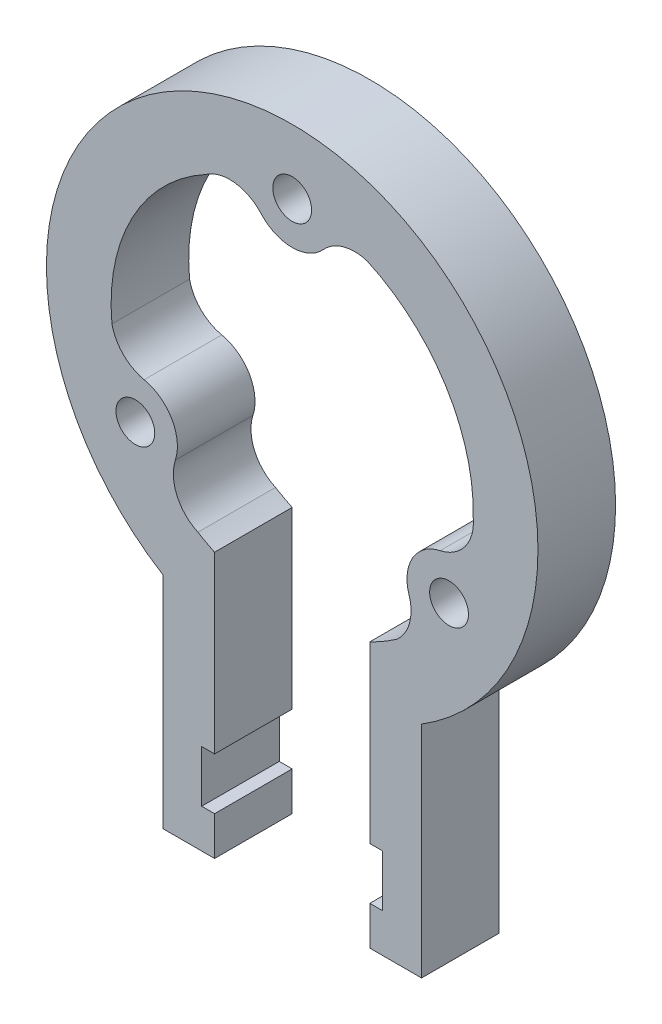
ISO-10303-21;
HEADER;
FILE_DESCRIPTION(('STEP AP214'),'2;1');
FILE_NAME('part.step','',(''),(''),'','','');
FILE_SCHEMA(('AUTOMOTIVE_DESIGN { 1 0 10303 214 1 1 1 1 }'));
ENDSEC;
DATA;
#1=APPLICATION_CONTEXT('core data for automotive mechanical design processes');
#2=APPLICATION_PROTOCOL_DEFINITION('international standard','automotive_design',2000,#1);
#3=PRODUCT_CONTEXT('',#1,'mechanical');
#4=PRODUCT('Part','Part','',(#3));
#5=PRODUCT_RELATED_PRODUCT_CATEGORY('part','',(#4));
#6=PRODUCT_DEFINITION_FORMATION('','',#4);
#7=PRODUCT_DEFINITION_CONTEXT('part definition',#1,'design');
#8=PRODUCT_DEFINITION('design','',#6,#7);
#9=PRODUCT_DEFINITION_SHAPE('','',#8);
#10=(LENGTH_UNIT() NAMED_UNIT(*) SI_UNIT(.MILLI.,.METRE.));
#11=(NAMED_UNIT(*) PLANE_ANGLE_UNIT() SI_UNIT($,.RADIAN.));
#12=(NAMED_UNIT(*) SI_UNIT($,.STERADIAN.) SOLID_ANGLE_UNIT());
#13=UNCERTAINTY_MEASURE_WITH_UNIT(LENGTH_MEASURE(1.E-05),#10,'distance_accuracy_value','');
#14=(GEOMETRIC_REPRESENTATION_CONTEXT(3) GLOBAL_UNCERTAINTY_ASSIGNED_CONTEXT((#13)) GLOBAL_UNIT_ASSIGNED_CONTEXT((#10,
#11,#12)) REPRESENTATION_CONTEXT('',''));
#15=CARTESIAN_POINT('',(0.,0.,0.));
#16=DIRECTION('',(0.,0.,1.));
#17=DIRECTION('',(1.,0.,0.));
#18=AXIS2_PLACEMENT_3D('',#15,#16,#17);
#19=CARTESIAN_POINT('',(0.,0.,6.));
#20=DIRECTION('',(0.,0.,1.));
#21=DIRECTION('',(1.,0.,0.));
#22=AXIS2_PLACEMENT_3D('',#19,#20,#21);
#23=PLANE('',#22);
#24=CARTESIAN_POINT('',(12.124355652982,-7.00000000000017,6.));
#25=DIRECTION('',(0.,0.,1.));
#26=DIRECTION('',(1.,0.,0.));
#27=AXIS2_PLACEMENT_3D('',#24,#25,#26);
#28=CIRCLE('',#27,1.50000000000007);
#29=CARTESIAN_POINT('',(13.6243556529821,-7.00000000000017,6.));
#30=VERTEX_POINT('',#29);
#31=EDGE_CURVE('E494',#30,#30,#28,.T.);
#32=ORIENTED_EDGE('',*,*,#31,.F.);
#33=EDGE_LOOP('',(#32));
#34=FACE_BOUND('',#33,.T.);
#35=DIRECTION('',(-1.,0.,0.));
#36=VECTOR('',#35,1.);
#37=CARTESIAN_POINT('',(-7.0000000000001,-30.1554944214036,6.));
#38=LINE('',#37,#36);
#39=CARTESIAN_POINT('',(-6.0000000000001,-30.1554944214036,6.));
#40=VERTEX_POINT('',#39);
#41=CARTESIAN_POINT('',(-7.0000000000001,-30.1554944214036,6.));
#42=VERTEX_POINT('',#41);
#43=EDGE_CURVE('E305',#40,#42,#38,.T.);
#44=ORIENTED_EDGE('',*,*,#43,.T.);
#45=DIRECTION('',(0.,1.,0.));
#46=VECTOR('',#45,1.);
#47=CARTESIAN_POINT('',(-7.00000000000009,-26.1554944214036,6.));
#48=LINE('',#47,#46);
#49=CARTESIAN_POINT('',(-7.00000000000009,-26.1554944214036,6.));
#50=VERTEX_POINT('',#49);
#51=EDGE_CURVE('E153',#42,#50,#48,.T.);
#52=ORIENTED_EDGE('',*,*,#51,.T.);
#53=DIRECTION('',(1.,0.,0.));
#54=VECTOR('',#53,1.);
#55=CARTESIAN_POINT('',(-7.00000000000009,-26.1554944214036,6.));
#56=LINE('',#55,#54);
#57=CARTESIAN_POINT('',(-6.00000000000009,-26.1554944214036,6.));
#58=VERTEX_POINT('',#57);
#59=EDGE_CURVE('E380',#50,#58,#56,.T.);
#60=ORIENTED_EDGE('',*,*,#59,.T.);
#61=DIRECTION('',(0.,1.,0.));
#62=VECTOR('',#61,1.);
#63=CARTESIAN_POINT('',(-6.00000000000009,-26.1554944214036,6.));
#64=LINE('',#63,#62);
#65=CARTESIAN_POINT('',(-6.0000000000001,-12.6491106406735,6.));
#66=VERTEX_POINT('',#65);
#67=EDGE_CURVE('E399',#58,#66,#64,.T.);
#68=ORIENTED_EDGE('',*,*,#67,.T.);
#69=CARTESIAN_POINT('',(0.,0.,6.));
#70=DIRECTION('',(0.,0.,-1.));
#71=DIRECTION('',(1.,0.,0.));
#72=AXIS2_PLACEMENT_3D('',#69,#70,#71);
#73=CIRCLE('',#72,14.);
#74=CARTESIAN_POINT('',(-7.28860608140232,-11.9530841789952,6.));
#75=VERTEX_POINT('',#74);
#76=EDGE_CURVE('E396',#66,#75,#73,.T.);
#77=ORIENTED_EDGE('',*,*,#76,.T.);
#78=CARTESIAN_POINT('',(-5.93863769378334,-8.99672064376658,6.));
#79=DIRECTION('',(0.,0.,-1.));
#80=DIRECTION('',(1.,0.,0.));
#81=AXIS2_PLACEMENT_3D('',#78,#79,#80);
#82=CIRCLE('',#81,3.25);
#83=CARTESIAN_POINT('',(-9.03149667338279,-7.9983603218832,6.));
#84=VERTEX_POINT('',#83);
#85=EDGE_CURVE('E398',#75,#84,#82,.T.);
#86=ORIENTED_EDGE('',*,*,#85,.T.);
#87=CARTESIAN_POINT('',(-12.1243556529822,-6.99999999999983,6.));
#88=DIRECTION('',(0.,0.,1.));
#89=DIRECTION('',(1.,0.,0.));
#90=AXIS2_PLACEMENT_3D('',#87,#88,#89);
#91=CIRCLE('',#90,3.25);
#92=CARTESIAN_POINT('',(-11.4425315640638,-3.82232539240223,6.));
#93=VERTEX_POINT('',#92);
#94=EDGE_CURVE('E401',#84,#93,#91,.T.);
#95=ORIENTED_EDGE('',*,*,#94,.T.);
#96=CARTESIAN_POINT('',(-10.7607074751454,-0.644650784804622,6.));
#97=DIRECTION('',(0.,0.,-1.));
#98=DIRECTION('',(1.,0.,0.));
#99=AXIS2_PLACEMENT_3D('',#96,#97,#98);
#100=CIRCLE('',#99,3.25);
#101=CARTESIAN_POINT('',(-13.9359386105091,-1.33776494352389,6.));
#102=VERTEX_POINT('',#101);
#103=EDGE_CURVE('E407',#93,#102,#100,.T.);
#104=ORIENTED_EDGE('',*,*,#103,.T.);
#105=CARTESIAN_POINT('',(0.,0.,6.));
#106=DIRECTION('',(0.,0.,-1.));
#107=DIRECTION('',(1.,0.,0.));
#108=AXIS2_PLACEMENT_3D('',#105,#106,#107);
#109=CIRCLE('',#108,14.);
#110=CARTESIAN_POINT('',(-6.70737151188253,12.2886601141698,6.));
#111=VERTEX_POINT('',#110);
#112=EDGE_CURVE('E409',#102,#111,#109,.T.);
#113=ORIENTED_EDGE('',*,*,#112,.T.);
#114=CARTESIAN_POINT('',(-4.82206978136206,9.6413714285715,6.));
#115=DIRECTION('',(0.,0.,-1.));
#116=DIRECTION('',(1.,0.,0.));
#117=AXIS2_PLACEMENT_3D('',#114,#115,#116);
#118=CIRCLE('',#117,3.25);
#119=CARTESIAN_POINT('',(-2.41103489068093,11.8206857142858,6.));
#120=VERTEX_POINT('',#119);
#121=EDGE_CURVE('E411',#111,#120,#118,.T.);
#122=ORIENTED_EDGE('',*,*,#121,.T.);
#123=CARTESIAN_POINT('',(2.07934408239977E-13,14.,6.));
#124=DIRECTION('',(0.,0.,1.));
#125=DIRECTION('',(1.,0.,0.));
#126=AXIS2_PLACEMENT_3D('',#123,#124,#125);
#127=CIRCLE('',#126,3.25);
#128=CARTESIAN_POINT('',(2.41103489068127,11.8206857142857,6.));
#129=VERTEX_POINT('',#128);
#130=EDGE_CURVE('E413',#120,#129,#127,.T.);
#131=ORIENTED_EDGE('',*,*,#130,.T.);
#132=CARTESIAN_POINT('',(4.82206978136234,9.64137142857136,6.));
#133=DIRECTION('',(0.,0.,-1.));
#134=DIRECTION('',(1.,0.,0.));
#135=AXIS2_PLACEMENT_3D('',#132,#133,#134);
#136=CIRCLE('',#135,3.25);
#137=CARTESIAN_POINT('',(5.80943087987061,12.7377593340432,6.));
#138=VERTEX_POINT('',#137);
#139=EDGE_CURVE('E415',#129,#138,#136,.T.);
#140=ORIENTED_EDGE('',*,*,#139,.T.);
#141=CARTESIAN_POINT('',(0.,0.,6.));
#142=DIRECTION('',(0.,0.,-1.));
#143=DIRECTION('',(1.,0.,0.));
#144=AXIS2_PLACEMENT_3D('',#141,#142,#143);
#145=CIRCLE('',#144,14.);
#146=CARTESIAN_POINT('',(13.9959775932849,-0.335575935174566,6.));
#147=VERTEX_POINT('',#146);
#148=EDGE_CURVE('E417',#138,#147,#145,.T.);
#149=ORIENTED_EDGE('',*,*,#148,.T.);
#150=CARTESIAN_POINT('',(10.7607074751454,-0.644650784804921,6.));
#151=DIRECTION('',(0.,0.,-1.));
#152=DIRECTION('',(1.,0.,0.));
#153=AXIS2_PLACEMENT_3D('',#150,#151,#152);
#154=CIRCLE('',#153,3.25);
#155=CARTESIAN_POINT('',(11.4425315640637,-3.82232539240255,6.));
#156=VERTEX_POINT('',#155);
#157=EDGE_CURVE('E419',#147,#156,#154,.T.);
#158=ORIENTED_EDGE('',*,*,#157,.T.);
#159=CARTESIAN_POINT('',(12.124355652982,-7.00000000000017,6.));
#160=DIRECTION('',(0.,0.,1.));
#161=DIRECTION('',(1.,0.,0.));
#162=AXIS2_PLACEMENT_3D('',#159,#160,#161);
#163=CIRCLE('',#162,3.25);
#164=CARTESIAN_POINT('',(9.03149667338257,-7.99836032188346,6.));
#165=VERTEX_POINT('',#164);
#166=EDGE_CURVE('E421',#156,#165,#163,.T.);
#167=ORIENTED_EDGE('',*,*,#166,.T.);
#168=CARTESIAN_POINT('',(5.93863769378309,-8.99672064376674,6.));
#169=DIRECTION('',(0.,0.,-1.));
#170=DIRECTION('',(1.,0.,0.));
#171=AXIS2_PLACEMENT_3D('',#168,#169,#170);
#172=CIRCLE('',#171,3.25);
#173=CARTESIAN_POINT('',(8.12650773063849,-11.3999943905194,6.));
#174=VERTEX_POINT('',#173);
#175=EDGE_CURVE('E423',#165,#174,#172,.T.);
#176=ORIENTED_EDGE('',*,*,#175,.T.);
#177=CARTESIAN_POINT('',(0.,0.,6.));
#178=DIRECTION('',(0.,0.,-1.));
#179=DIRECTION('',(1.,0.,0.));
#180=AXIS2_PLACEMENT_3D('',#177,#178,#179);
#181=CIRCLE('',#180,14.);
#182=CARTESIAN_POINT('',(5.9999999999999,-12.6491106406736,6.));
#183=VERTEX_POINT('',#182);
#184=EDGE_CURVE('E425',#174,#183,#181,.T.);
#185=ORIENTED_EDGE('',*,*,#184,.T.);
#186=DIRECTION('',(0.,-1.,0.));
#187=VECTOR('',#186,1.);
#188=CARTESIAN_POINT('',(5.99999999999991,-26.1554944214036,6.));
#189=LINE('',#188,#187);
#190=CARTESIAN_POINT('',(5.99999999999991,-26.1554944214036,6.));
#191=VERTEX_POINT('',#190);
#192=EDGE_CURVE('E427',#183,#191,#189,.T.);
#193=ORIENTED_EDGE('',*,*,#192,.T.);
#194=DIRECTION('',(1.,0.,0.));
#195=VECTOR('',#194,1.);
#196=CARTESIAN_POINT('',(5.99999999999991,-26.1554944214036,6.));
#197=LINE('',#196,#195);
#198=CARTESIAN_POINT('',(6.99999999999991,-26.1554944214036,6.));
#199=VERTEX_POINT('',#198);
#200=EDGE_CURVE('E429',#191,#199,#197,.T.);
#201=ORIENTED_EDGE('',*,*,#200,.T.);
#202=DIRECTION('',(0.,-1.,0.));
#203=VECTOR('',#202,1.);
#204=CARTESIAN_POINT('',(6.99999999999991,-26.1554944214036,6.));
#205=LINE('',#204,#203);
#206=CARTESIAN_POINT('',(6.9999999999999,-30.1554944214036,6.));
#207=VERTEX_POINT('',#206);
#208=EDGE_CURVE('E431',#199,#207,#205,.T.);
#209=ORIENTED_EDGE('',*,*,#208,.T.);
#210=DIRECTION('',(-1.,0.,0.));
#211=VECTOR('',#210,1.);
#212=CARTESIAN_POINT('',(5.9999999999999,-30.1554944214036,6.));
#213=LINE('',#212,#211);
#214=CARTESIAN_POINT('',(5.9999999999999,-30.1554944214036,6.));
#215=VERTEX_POINT('',#214);
#216=EDGE_CURVE('E433',#207,#215,#213,.T.);
#217=ORIENTED_EDGE('',*,*,#216,.T.);
#218=DIRECTION('',(0.,-1.,0.));
#219=VECTOR('',#218,1.);
#220=CARTESIAN_POINT('',(5.9999999999999,-33.1554944214036,6.));
#221=LINE('',#220,#219);
#222=CARTESIAN_POINT('',(5.9999999999999,-33.1554944214036,6.));
#223=VERTEX_POINT('',#222);
#224=EDGE_CURVE('E435',#215,#223,#221,.T.);
#225=ORIENTED_EDGE('',*,*,#224,.T.);
#226=DIRECTION('',(1.,0.,0.));
#227=VECTOR('',#226,1.);
#228=CARTESIAN_POINT('',(9.9999999999999,-33.1554944214036,6.));
#229=LINE('',#228,#227);
#230=CARTESIAN_POINT('',(9.9999999999999,-33.1554944214036,6.));
#231=VERTEX_POINT('',#230);
#232=EDGE_CURVE('E437',#223,#231,#229,.T.);
#233=ORIENTED_EDGE('',*,*,#232,.T.);
#234=DIRECTION('',(0.,1.,0.));
#235=VECTOR('',#234,1.);
#236=CARTESIAN_POINT('',(9.9999999999999,-16.1554944214036,6.));
#237=LINE('',#236,#235);
#238=CARTESIAN_POINT('',(9.9999999999999,-16.1554944214036,6.));
#239=VERTEX_POINT('',#238);
#240=EDGE_CURVE('E439',#231,#239,#237,.T.);
#241=ORIENTED_EDGE('',*,*,#240,.T.);
#242=CARTESIAN_POINT('',(0.,0.,6.));
#243=DIRECTION('',(0.,0.,1.));
#244=DIRECTION('',(1.,0.,0.));
#245=AXIS2_PLACEMENT_3D('',#242,#243,#244);
#246=CIRCLE('',#245,19.);
#247=CARTESIAN_POINT('',(-10.0000000000001,-16.1554944214034,6.));
#248=VERTEX_POINT('',#247);
#249=EDGE_CURVE('E232',#239,#248,#246,.T.);
#250=ORIENTED_EDGE('',*,*,#249,.T.);
#251=DIRECTION('',(0.,-1.,0.));
#252=VECTOR('',#251,1.);
#253=CARTESIAN_POINT('',(-10.0000000000001,-16.1554944214034,6.));
#254=LINE('',#253,#252);
#255=CARTESIAN_POINT('',(-10.0000000000001,-33.1554944214036,6.));
#256=VERTEX_POINT('',#255);
#257=EDGE_CURVE('E226',#248,#256,#254,.T.);
#258=ORIENTED_EDGE('',*,*,#257,.T.);
#259=DIRECTION('',(1.,0.,0.));
#260=VECTOR('',#259,1.);
#261=CARTESIAN_POINT('',(-6.0000000000001,-33.1554944214036,6.));
#262=LINE('',#261,#260);
#263=CARTESIAN_POINT('',(-6.0000000000001,-33.1554944214036,6.));
#264=VERTEX_POINT('',#263);
#265=EDGE_CURVE('E230',#256,#264,#262,.T.);
#266=ORIENTED_EDGE('',*,*,#265,.T.);
#267=DIRECTION('',(0.,1.,0.));
#268=VECTOR('',#267,1.);
#269=CARTESIAN_POINT('',(-6.0000000000001,-33.1554944214036,6.));
#270=LINE('',#269,#268);
#271=EDGE_CURVE('E50',#264,#40,#270,.T.);
#272=ORIENTED_EDGE('',*,*,#271,.T.);
#273=EDGE_LOOP('',(#44,#52,#60,#68,#77,#86,#95,#104,#113,#122,#131,#140,#149,#158,#167,#176,
#185,#193,#201,#209,#217,#225,#233,#241,#250,#258,#266,#272));
#274=FACE_BOUND('',#273,.T.);
#275=CARTESIAN_POINT('',(2.07934408239977E-13,14.,6.));
#276=DIRECTION('',(0.,0.,1.));
#277=DIRECTION('',(1.,0.,0.));
#278=AXIS2_PLACEMENT_3D('',#275,#276,#277);
#279=CIRCLE('',#278,1.5);
#280=CARTESIAN_POINT('',(1.50000000000021,14.,6.));
#281=VERTEX_POINT('',#280);
#282=EDGE_CURVE('E254',#281,#281,#279,.T.);
#283=ORIENTED_EDGE('',*,*,#282,.F.);
#284=EDGE_LOOP('',(#283));
#285=FACE_BOUND('',#284,.T.);
#286=CARTESIAN_POINT('',(-12.1243556529822,-6.99999999999983,6.));
#287=DIRECTION('',(0.,0.,1.));
#288=DIRECTION('',(1.,0.,0.));
#289=AXIS2_PLACEMENT_3D('',#286,#287,#288);
#290=CIRCLE('',#289,1.5);
#291=CARTESIAN_POINT('',(-10.6243556529822,-6.99999999999983,6.));
#292=VERTEX_POINT('',#291);
#293=EDGE_CURVE('E485',#292,#292,#290,.T.);
#294=ORIENTED_EDGE('',*,*,#293,.F.);
#295=EDGE_LOOP('',(#294));
#296=FACE_BOUND('',#295,.T.);
#297=ADVANCED_FACE('F33',(#34,#274,#285,#296),#23,.T.);
#298=CARTESIAN_POINT('',(0.,0.,0.));
#299=DIRECTION('',(0.,0.,1.));
#300=DIRECTION('',(1.,0.,0.));
#301=AXIS2_PLACEMENT_3D('',#298,#299,#300);
#302=PLANE('',#301);
#303=DIRECTION('',(-1.,0.,0.));
#304=VECTOR('',#303,1.);
#305=CARTESIAN_POINT('',(-7.0000000000001,-30.1554944214036,0.));
#306=LINE('',#305,#304);
#307=CARTESIAN_POINT('',(-6.0000000000001,-30.1554944214036,0.));
#308=VERTEX_POINT('',#307);
#309=CARTESIAN_POINT('',(-7.0000000000001,-30.1554944214036,0.));
#310=VERTEX_POINT('',#309);
#311=EDGE_CURVE('E250',#308,#310,#306,.T.);
#312=ORIENTED_EDGE('',*,*,#311,.F.);
#313=DIRECTION('',(0.,1.,0.));
#314=VECTOR('',#313,1.);
#315=CARTESIAN_POINT('',(-6.0000000000001,-33.1554944214036,0.));
#316=LINE('',#315,#314);
#317=CARTESIAN_POINT('',(-6.0000000000001,-33.1554944214036,0.));
#318=VERTEX_POINT('',#317);
#319=EDGE_CURVE('E145',#318,#308,#316,.T.);
#320=ORIENTED_EDGE('',*,*,#319,.F.);
#321=DIRECTION('',(1.,0.,0.));
#322=VECTOR('',#321,1.);
#323=CARTESIAN_POINT('',(-6.0000000000001,-33.1554944214036,0.));
#324=LINE('',#323,#322);
#325=CARTESIAN_POINT('',(-10.0000000000001,-33.1554944214036,0.));
#326=VERTEX_POINT('',#325);
#327=EDGE_CURVE('E139',#326,#318,#324,.T.);
#328=ORIENTED_EDGE('',*,*,#327,.F.);
#329=DIRECTION('',(0.,-1.,0.));
#330=VECTOR('',#329,1.);
#331=CARTESIAN_POINT('',(-10.0000000000001,-16.1554944214034,0.));
#332=LINE('',#331,#330);
#333=CARTESIAN_POINT('',(-10.0000000000001,-16.1554944214034,0.));
#334=VERTEX_POINT('',#333);
#335=EDGE_CURVE('E240',#334,#326,#332,.T.);
#336=ORIENTED_EDGE('',*,*,#335,.F.);
#337=CARTESIAN_POINT('',(0.,0.,0.));
#338=DIRECTION('',(0.,0.,1.));
#339=DIRECTION('',(1.,0.,0.));
#340=AXIS2_PLACEMENT_3D('',#337,#338,#339);
#341=CIRCLE('',#340,19.);
#342=CARTESIAN_POINT('',(9.9999999999999,-16.1554944214036,0.));
#343=VERTEX_POINT('',#342);
#344=EDGE_CURVE('E300',#343,#334,#341,.T.);
#345=ORIENTED_EDGE('',*,*,#344,.F.);
#346=DIRECTION('',(0.,1.,0.));
#347=VECTOR('',#346,1.);
#348=CARTESIAN_POINT('',(9.9999999999999,-16.1554944214036,0.));
#349=LINE('',#348,#347);
#350=CARTESIAN_POINT('',(9.9999999999999,-33.1554944214036,0.));
#351=VERTEX_POINT('',#350);
#352=EDGE_CURVE('E298',#351,#343,#349,.T.);
#353=ORIENTED_EDGE('',*,*,#352,.F.);
#354=DIRECTION('',(1.,0.,0.));
#355=VECTOR('',#354,1.);
#356=CARTESIAN_POINT('',(9.9999999999999,-33.1554944214036,0.));
#357=LINE('',#356,#355);
#358=CARTESIAN_POINT('',(5.9999999999999,-33.1554944214036,0.));
#359=VERTEX_POINT('',#358);
#360=EDGE_CURVE('E296',#359,#351,#357,.T.);
#361=ORIENTED_EDGE('',*,*,#360,.F.);
#362=DIRECTION('',(0.,-1.,0.));
#363=VECTOR('',#362,1.);
#364=CARTESIAN_POINT('',(5.9999999999999,-33.1554944214036,0.));
#365=LINE('',#364,#363);
#366=CARTESIAN_POINT('',(5.9999999999999,-30.1554944214036,0.));
#367=VERTEX_POINT('',#366);
#368=EDGE_CURVE('E294',#367,#359,#365,.T.);
#369=ORIENTED_EDGE('',*,*,#368,.F.);
#370=DIRECTION('',(-1.,0.,0.));
#371=VECTOR('',#370,1.);
#372=CARTESIAN_POINT('',(5.9999999999999,-30.1554944214036,0.));
#373=LINE('',#372,#371);
#374=CARTESIAN_POINT('',(6.9999999999999,-30.1554944214036,0.));
#375=VERTEX_POINT('',#374);
#376=EDGE_CURVE('E292',#375,#367,#373,.T.);
#377=ORIENTED_EDGE('',*,*,#376,.F.);
#378=DIRECTION('',(0.,-1.,0.));
#379=VECTOR('',#378,1.);
#380=CARTESIAN_POINT('',(6.99999999999991,-26.1554944214036,0.));
#381=LINE('',#380,#379);
#382=CARTESIAN_POINT('',(6.99999999999991,-26.1554944214036,0.));
#383=VERTEX_POINT('',#382);
#384=EDGE_CURVE('E290',#383,#375,#381,.T.);
#385=ORIENTED_EDGE('',*,*,#384,.F.);
#386=DIRECTION('',(1.,0.,0.));
#387=VECTOR('',#386,1.);
#388=CARTESIAN_POINT('',(5.99999999999991,-26.1554944214036,0.));
#389=LINE('',#388,#387);
#390=CARTESIAN_POINT('',(5.99999999999991,-26.1554944214036,0.));
#391=VERTEX_POINT('',#390);
#392=EDGE_CURVE('E288',#391,#383,#389,.T.);
#393=ORIENTED_EDGE('',*,*,#392,.F.);
#394=DIRECTION('',(0.,-1.,0.));
#395=VECTOR('',#394,1.);
#396=CARTESIAN_POINT('',(5.99999999999991,-26.1554944214036,0.));
#397=LINE('',#396,#395);
#398=CARTESIAN_POINT('',(5.9999999999999,-12.6491106406736,0.));
#399=VERTEX_POINT('',#398);
#400=EDGE_CURVE('E286',#399,#391,#397,.T.);
#401=ORIENTED_EDGE('',*,*,#400,.F.);
#402=CARTESIAN_POINT('',(0.,0.,0.));
#403=DIRECTION('',(0.,0.,-1.));
#404=DIRECTION('',(1.,0.,0.));
#405=AXIS2_PLACEMENT_3D('',#402,#403,#404);
#406=CIRCLE('',#405,14.);
#407=CARTESIAN_POINT('',(8.12650773063849,-11.3999943905194,0.));
#408=VERTEX_POINT('',#407);
#409=EDGE_CURVE('E284',#408,#399,#406,.T.);
#410=ORIENTED_EDGE('',*,*,#409,.F.);
#411=CARTESIAN_POINT('',(5.93863769378309,-8.99672064376674,0.));
#412=DIRECTION('',(0.,0.,-1.));
#413=DIRECTION('',(1.,0.,0.));
#414=AXIS2_PLACEMENT_3D('',#411,#412,#413);
#415=CIRCLE('',#414,3.25);
#416=CARTESIAN_POINT('',(9.03149667338257,-7.99836032188346,0.));
#417=VERTEX_POINT('',#416);
#418=EDGE_CURVE('E282',#417,#408,#415,.T.);
#419=ORIENTED_EDGE('',*,*,#418,.F.);
#420=CARTESIAN_POINT('',(12.124355652982,-7.00000000000017,0.));
#421=DIRECTION('',(0.,0.,1.));
#422=DIRECTION('',(1.,0.,0.));
#423=AXIS2_PLACEMENT_3D('',#420,#421,#422);
#424=CIRCLE('',#423,3.25);
#425=CARTESIAN_POINT('',(11.4425315640637,-3.82232539240255,0.));
#426=VERTEX_POINT('',#425);
#427=EDGE_CURVE('E280',#426,#417,#424,.T.);
#428=ORIENTED_EDGE('',*,*,#427,.F.);
#429=CARTESIAN_POINT('',(10.7607074751454,-0.644650784804921,0.));
#430=DIRECTION('',(0.,0.,-1.));
#431=DIRECTION('',(1.,0.,0.));
#432=AXIS2_PLACEMENT_3D('',#429,#430,#431);
#433=CIRCLE('',#432,3.25);
#434=CARTESIAN_POINT('',(13.9959775932849,-0.335575935174566,0.));
#435=VERTEX_POINT('',#434);
#436=EDGE_CURVE('E278',#435,#426,#433,.T.);
#437=ORIENTED_EDGE('',*,*,#436,.F.);
#438=CARTESIAN_POINT('',(0.,0.,0.));
#439=DIRECTION('',(0.,0.,-1.));
#440=DIRECTION('',(1.,0.,0.));
#441=AXIS2_PLACEMENT_3D('',#438,#439,#440);
#442=CIRCLE('',#441,14.);
#443=CARTESIAN_POINT('',(5.80943087987061,12.7377593340432,0.));
#444=VERTEX_POINT('',#443);
#445=EDGE_CURVE('E276',#444,#435,#442,.T.);
#446=ORIENTED_EDGE('',*,*,#445,.F.);
#447=CARTESIAN_POINT('',(4.82206978136234,9.64137142857136,0.));
#448=DIRECTION('',(0.,0.,-1.));
#449=DIRECTION('',(1.,0.,0.));
#450=AXIS2_PLACEMENT_3D('',#447,#448,#449);
#451=CIRCLE('',#450,3.25);
#452=CARTESIAN_POINT('',(2.41103489068127,11.8206857142857,0.));
#453=VERTEX_POINT('',#452);
#454=EDGE_CURVE('E274',#453,#444,#451,.T.);
#455=ORIENTED_EDGE('',*,*,#454,.F.);
#456=CARTESIAN_POINT('',(2.07934408239977E-13,14.,0.));
#457=DIRECTION('',(0.,0.,1.));
#458=DIRECTION('',(1.,0.,0.));
#459=AXIS2_PLACEMENT_3D('',#456,#457,#458);
#460=CIRCLE('',#459,3.25);
#461=CARTESIAN_POINT('',(-2.41103489068093,11.8206857142858,0.));
#462=VERTEX_POINT('',#461);
#463=EDGE_CURVE('E272',#462,#453,#460,.T.);
#464=ORIENTED_EDGE('',*,*,#463,.F.);
#465=CARTESIAN_POINT('',(-4.82206978136206,9.6413714285715,0.));
#466=DIRECTION('',(0.,0.,-1.));
#467=DIRECTION('',(1.,0.,0.));
#468=AXIS2_PLACEMENT_3D('',#465,#466,#467);
#469=CIRCLE('',#468,3.25);
#470=CARTESIAN_POINT('',(-6.70737151188253,12.2886601141698,0.));
#471=VERTEX_POINT('',#470);
#472=EDGE_CURVE('E270',#471,#462,#469,.T.);
#473=ORIENTED_EDGE('',*,*,#472,.F.);
#474=CARTESIAN_POINT('',(0.,0.,0.));
#475=DIRECTION('',(0.,0.,-1.));
#476=DIRECTION('',(1.,0.,0.));
#477=AXIS2_PLACEMENT_3D('',#474,#475,#476);
#478=CIRCLE('',#477,14.);
#479=CARTESIAN_POINT('',(-13.9359386105091,-1.33776494352389,0.));
#480=VERTEX_POINT('',#479);
#481=EDGE_CURVE('E268',#480,#471,#478,.T.);
#482=ORIENTED_EDGE('',*,*,#481,.F.);
#483=CARTESIAN_POINT('',(-10.7607074751454,-0.644650784804622,0.));
#484=DIRECTION('',(0.,0.,-1.));
#485=DIRECTION('',(1.,0.,0.));
#486=AXIS2_PLACEMENT_3D('',#483,#484,#485);
#487=CIRCLE('',#486,3.25);
#488=CARTESIAN_POINT('',(-11.4425315640638,-3.82232539240223,0.));
#489=VERTEX_POINT('',#488);
#490=EDGE_CURVE('E266',#489,#480,#487,.T.);
#491=ORIENTED_EDGE('',*,*,#490,.F.);
#492=CARTESIAN_POINT('',(-12.1243556529822,-6.99999999999983,0.));
#493=DIRECTION('',(0.,0.,1.));
#494=DIRECTION('',(1.,0.,0.));
#495=AXIS2_PLACEMENT_3D('',#492,#493,#494);
#496=CIRCLE('',#495,3.25);
#497=CARTESIAN_POINT('',(-9.03149667338279,-7.9983603218832,0.));
#498=VERTEX_POINT('',#497);
#499=EDGE_CURVE('E264',#498,#489,#496,.T.);
#500=ORIENTED_EDGE('',*,*,#499,.F.);
#501=CARTESIAN_POINT('',(-5.93863769378334,-8.99672064376658,0.));
#502=DIRECTION('',(0.,0.,-1.));
#503=DIRECTION('',(1.,0.,0.));
#504=AXIS2_PLACEMENT_3D('',#501,#502,#503);
#505=CIRCLE('',#504,3.25);
#506=CARTESIAN_POINT('',(-7.28860608140232,-11.9530841789952,0.));
#507=VERTEX_POINT('',#506);
#508=EDGE_CURVE('E262',#507,#498,#505,.T.);
#509=ORIENTED_EDGE('',*,*,#508,.F.);
#510=CARTESIAN_POINT('',(0.,0.,0.));
#511=DIRECTION('',(0.,0.,-1.));
#512=DIRECTION('',(1.,0.,0.));
#513=AXIS2_PLACEMENT_3D('',#510,#511,#512);
#514=CIRCLE('',#513,14.);
#515=CARTESIAN_POINT('',(-6.0000000000001,-12.6491106406735,0.));
#516=VERTEX_POINT('',#515);
#517=EDGE_CURVE('E260',#516,#507,#514,.T.);
#518=ORIENTED_EDGE('',*,*,#517,.F.);
#519=DIRECTION('',(0.,1.,0.));
#520=VECTOR('',#519,1.);
#521=CARTESIAN_POINT('',(-6.00000000000009,-26.1554944214036,0.));
#522=LINE('',#521,#520);
#523=CARTESIAN_POINT('',(-6.00000000000009,-26.1554944214036,0.));
#524=VERTEX_POINT('',#523);
#525=EDGE_CURVE('E258',#524,#516,#522,.T.);
#526=ORIENTED_EDGE('',*,*,#525,.F.);
#527=DIRECTION('',(1.,0.,0.));
#528=VECTOR('',#527,1.);
#529=CARTESIAN_POINT('',(-7.00000000000009,-26.1554944214036,0.));
#530=LINE('',#529,#528);
#531=CARTESIAN_POINT('',(-7.00000000000009,-26.1554944214036,0.));
#532=VERTEX_POINT('',#531);
#533=EDGE_CURVE('E256',#532,#524,#530,.T.);
#534=ORIENTED_EDGE('',*,*,#533,.F.);
#535=DIRECTION('',(0.,1.,0.));
#536=VECTOR('',#535,1.);
#537=CARTESIAN_POINT('',(-7.00000000000009,-26.1554944214036,0.));
#538=LINE('',#537,#536);
#539=EDGE_CURVE('E253',#310,#532,#538,.T.);
#540=ORIENTED_EDGE('',*,*,#539,.F.);
#541=EDGE_LOOP('',(#312,#320,#328,#336,#345,#353,#361,#369,#377,#385,#393,#401,#410,#419,#428,
#437,#446,#455,#464,#473,#482,#491,#500,#509,#518,#526,#534,#540));
#542=FACE_BOUND('',#541,.T.);
#543=CARTESIAN_POINT('',(2.07934408239977E-13,14.,0.));
#544=DIRECTION('',(0.,0.,1.));
#545=DIRECTION('',(1.,0.,0.));
#546=AXIS2_PLACEMENT_3D('',#543,#544,#545);
#547=CIRCLE('',#546,1.5);
#548=CARTESIAN_POINT('',(1.50000000000021,14.,0.));
#549=VERTEX_POINT('',#548);
#550=EDGE_CURVE('E497',#549,#549,#547,.T.);
#551=ORIENTED_EDGE('',*,*,#550,.T.);
#552=EDGE_LOOP('',(#551));
#553=FACE_BOUND('',#552,.T.);
#554=CARTESIAN_POINT('',(12.124355652982,-7.00000000000017,0.));
#555=DIRECTION('',(0.,0.,1.));
#556=DIRECTION('',(1.,0.,0.));
#557=AXIS2_PLACEMENT_3D('',#554,#555,#556);
#558=CIRCLE('',#557,1.50000000000007);
#559=CARTESIAN_POINT('',(13.6243556529821,-7.00000000000017,0.));
#560=VERTEX_POINT('',#559);
#561=EDGE_CURVE('E491',#560,#560,#558,.T.);
#562=ORIENTED_EDGE('',*,*,#561,.T.);
#563=EDGE_LOOP('',(#562));
#564=FACE_BOUND('',#563,.T.);
#565=CARTESIAN_POINT('',(-12.1243556529822,-6.99999999999983,0.));
#566=DIRECTION('',(0.,0.,1.));
#567=DIRECTION('',(1.,0.,0.));
#568=AXIS2_PLACEMENT_3D('',#565,#566,#567);
#569=CIRCLE('',#568,1.5);
#570=CARTESIAN_POINT('',(-10.6243556529822,-6.99999999999983,0.));
#571=VERTEX_POINT('',#570);
#572=EDGE_CURVE('E488',#571,#571,#569,.T.);
#573=ORIENTED_EDGE('',*,*,#572,.T.);
#574=EDGE_LOOP('',(#573));
#575=FACE_BOUND('',#574,.T.);
#576=ADVANCED_FACE('F384',(#542,#553,#564,#575),#302,.F.);
#577=CARTESIAN_POINT('',(-7.0000000000001,-30.1554944214036,6.));
#578=DIRECTION('',(0.,-1.,0.));
#579=DIRECTION('',(0.,0.,-1.));
#580=AXIS2_PLACEMENT_3D('',#577,#578,#579);
#581=PLANE('',#580);
#582=ORIENTED_EDGE('',*,*,#311,.T.);
#583=DIRECTION('',(0.,0.,-1.));
#584=VECTOR('',#583,1.);
#585=CARTESIAN_POINT('',(-7.0000000000001,-30.1554944214036,6.));
#586=LINE('',#585,#584);
#587=EDGE_CURVE('E11',#42,#310,#586,.T.);
#588=ORIENTED_EDGE('',*,*,#587,.F.);
#589=ORIENTED_EDGE('',*,*,#43,.F.);
#590=DIRECTION('',(0.,0.,-1.));
#591=VECTOR('',#590,1.);
#592=CARTESIAN_POINT('',(-6.0000000000001,-30.1554944214036,6.));
#593=LINE('',#592,#591);
#594=EDGE_CURVE('E246',#40,#308,#593,.T.);
#595=ORIENTED_EDGE('',*,*,#594,.T.);
#596=EDGE_LOOP('',(#582,#588,#589,#595));
#597=FACE_BOUND('',#596,.T.);
#598=ADVANCED_FACE('F35',(#597),#581,.F.);
#599=CARTESIAN_POINT('',(-7.00000000000009,-26.1554944214036,6.));
#600=DIRECTION('',(-1.,0.,0.));
#601=DIRECTION('',(0.,-1.,0.));
#602=AXIS2_PLACEMENT_3D('',#599,#600,#601);
#603=PLANE('',#602);
#604=ORIENTED_EDGE('',*,*,#539,.T.);
#605=DIRECTION('',(0.,0.,-1.));
#606=VECTOR('',#605,1.);
#607=CARTESIAN_POINT('',(-7.00000000000009,-26.1554944214036,6.));
#608=LINE('',#607,#606);
#609=EDGE_CURVE('E42',#50,#532,#608,.T.);
#610=ORIENTED_EDGE('',*,*,#609,.F.);
#611=ORIENTED_EDGE('',*,*,#51,.F.);
#612=ORIENTED_EDGE('',*,*,#587,.T.);
#613=EDGE_LOOP('',(#604,#610,#611,#612));
#614=FACE_BOUND('',#613,.T.);
#615=ADVANCED_FACE('F759',(#614),#603,.F.);
#616=CARTESIAN_POINT('',(-7.00000000000009,-26.1554944214036,6.));
#617=DIRECTION('',(0.,1.,0.));
#618=DIRECTION('',(0.,0.,1.));
#619=AXIS2_PLACEMENT_3D('',#616,#617,#618);
#620=PLANE('',#619);
#621=ORIENTED_EDGE('',*,*,#533,.T.);
#622=DIRECTION('',(0.,0.,-1.));
#623=VECTOR('',#622,1.);
#624=CARTESIAN_POINT('',(-6.00000000000009,-26.1554944214036,6.));
#625=LINE('',#624,#623);
#626=EDGE_CURVE('E372',#58,#524,#625,.T.);
#627=ORIENTED_EDGE('',*,*,#626,.F.);
#628=ORIENTED_EDGE('',*,*,#59,.F.);
#629=ORIENTED_EDGE('',*,*,#609,.T.);
#630=EDGE_LOOP('',(#621,#627,#628,#629));
#631=FACE_BOUND('',#630,.T.);
#632=ADVANCED_FACE('F378',(#631),#620,.F.);
#633=CARTESIAN_POINT('',(-6.00000000000009,-26.1554944214036,6.));
#634=DIRECTION('',(-1.,0.,0.));
#635=DIRECTION('',(0.,-1.,0.));
#636=AXIS2_PLACEMENT_3D('',#633,#634,#635);
#637=PLANE('',#636);
#638=ORIENTED_EDGE('',*,*,#525,.T.);
#639=DIRECTION('',(0.,0.,-1.));
#640=VECTOR('',#639,1.);
#641=CARTESIAN_POINT('',(-6.0000000000001,-12.6491106406735,6.));
#642=LINE('',#641,#640);
#643=EDGE_CURVE('E369',#66,#516,#642,.T.);
#644=ORIENTED_EDGE('',*,*,#643,.F.);
#645=ORIENTED_EDGE('',*,*,#67,.F.);
#646=ORIENTED_EDGE('',*,*,#626,.T.);
#647=EDGE_LOOP('',(#638,#644,#645,#646));
#648=FACE_BOUND('',#647,.T.);
#649=ADVANCED_FACE('F390',(#648),#637,.F.);
#650=CARTESIAN_POINT('',(0.,0.,6.));
#651=DIRECTION('',(0.,0.,-1.));
#652=DIRECTION('',(-1.,0.,0.));
#653=AXIS2_PLACEMENT_3D('',#650,#651,#652);
#654=CYLINDRICAL_SURFACE('',#653,14.);
#655=ORIENTED_EDGE('',*,*,#517,.T.);
#656=DIRECTION('',(0.,0.,-1.));
#657=VECTOR('',#656,1.);
#658=CARTESIAN_POINT('',(-7.28860608140232,-11.9530841789952,6.));
#659=LINE('',#658,#657);
#660=EDGE_CURVE('E366',#75,#507,#659,.T.);
#661=ORIENTED_EDGE('',*,*,#660,.F.);
#662=ORIENTED_EDGE('',*,*,#76,.F.);
#663=ORIENTED_EDGE('',*,*,#643,.T.);
#664=EDGE_LOOP('',(#655,#661,#662,#663));
#665=FACE_BOUND('',#664,.T.);
#666=ADVANCED_FACE('F394',(#665),#654,.F.);
#667=CARTESIAN_POINT('',(-5.93863769378334,-8.99672064376658,6.));
#668=DIRECTION('',(0.,0.,-1.));
#669=DIRECTION('',(-1.,0.,0.));
#670=AXIS2_PLACEMENT_3D('',#667,#668,#669);
#671=CYLINDRICAL_SURFACE('',#670,3.25);
#672=ORIENTED_EDGE('',*,*,#508,.T.);
#673=DIRECTION('',(0.,0.,-1.));
#674=VECTOR('',#673,1.);
#675=CARTESIAN_POINT('',(-9.03149667338279,-7.9983603218832,6.));
#676=LINE('',#675,#674);
#677=EDGE_CURVE('E363',#84,#498,#676,.T.);
#678=ORIENTED_EDGE('',*,*,#677,.F.);
#679=ORIENTED_EDGE('',*,*,#85,.F.);
#680=ORIENTED_EDGE('',*,*,#660,.T.);
#681=EDGE_LOOP('',(#672,#678,#679,#680));
#682=FACE_BOUND('',#681,.T.);
#683=ADVANCED_FACE('F724',(#682),#671,.F.);
#684=CARTESIAN_POINT('',(-12.1243556529822,-6.99999999999983,6.));
#685=DIRECTION('',(0.,0.,-1.));
#686=DIRECTION('',(-1.,0.,0.));
#687=AXIS2_PLACEMENT_3D('',#684,#685,#686);
#688=CYLINDRICAL_SURFACE('',#687,3.25);
#689=ORIENTED_EDGE('',*,*,#499,.T.);
#690=DIRECTION('',(0.,0.,-1.));
#691=VECTOR('',#690,1.);
#692=CARTESIAN_POINT('',(-11.4425315640638,-3.82232539240223,6.));
#693=LINE('',#692,#691);
#694=EDGE_CURVE('E360',#93,#489,#693,.T.);
#695=ORIENTED_EDGE('',*,*,#694,.F.);
#696=ORIENTED_EDGE('',*,*,#94,.F.);
#697=ORIENTED_EDGE('',*,*,#677,.T.);
#698=EDGE_LOOP('',(#689,#695,#696,#697));
#699=FACE_BOUND('',#698,.T.);
#700=ADVANCED_FACE('F714',(#699),#688,.T.);
#701=CARTESIAN_POINT('',(-10.7607074751454,-0.644650784804622,6.));
#702=DIRECTION('',(0.,0.,-1.));
#703=DIRECTION('',(-1.,0.,0.));
#704=AXIS2_PLACEMENT_3D('',#701,#702,#703);
#705=CYLINDRICAL_SURFACE('',#704,3.25);
#706=ORIENTED_EDGE('',*,*,#490,.T.);
#707=DIRECTION('',(0.,0.,-1.));
#708=VECTOR('',#707,1.);
#709=CARTESIAN_POINT('',(-13.9359386105091,-1.33776494352389,6.));
#710=LINE('',#709,#708);
#711=EDGE_CURVE('E357',#102,#480,#710,.T.);
#712=ORIENTED_EDGE('',*,*,#711,.F.);
#713=ORIENTED_EDGE('',*,*,#103,.F.);
#714=ORIENTED_EDGE('',*,*,#694,.T.);
#715=EDGE_LOOP('',(#706,#712,#713,#714));
#716=FACE_BOUND('',#715,.T.);
#717=ADVANCED_FACE('F704',(#716),#705,.F.);
#718=CARTESIAN_POINT('',(0.,0.,6.));
#719=DIRECTION('',(0.,0.,-1.));
#720=DIRECTION('',(-1.,0.,0.));
#721=AXIS2_PLACEMENT_3D('',#718,#719,#720);
#722=CYLINDRICAL_SURFACE('',#721,14.);
#723=ORIENTED_EDGE('',*,*,#481,.T.);
#724=DIRECTION('',(0.,0.,-1.));
#725=VECTOR('',#724,1.);
#726=CARTESIAN_POINT('',(-6.70737151188253,12.2886601141698,6.));
#727=LINE('',#726,#725);
#728=EDGE_CURVE('E354',#111,#471,#727,.T.);
#729=ORIENTED_EDGE('',*,*,#728,.F.);
#730=ORIENTED_EDGE('',*,*,#112,.F.);
#731=ORIENTED_EDGE('',*,*,#711,.T.);
#732=EDGE_LOOP('',(#723,#729,#730,#731));
#733=FACE_BOUND('',#732,.T.);
#734=ADVANCED_FACE('F694',(#733),#722,.F.);
#735=CARTESIAN_POINT('',(-4.82206978136206,9.6413714285715,6.));
#736=DIRECTION('',(0.,0.,-1.));
#737=DIRECTION('',(-1.,0.,0.));
#738=AXIS2_PLACEMENT_3D('',#735,#736,#737);
#739=CYLINDRICAL_SURFACE('',#738,3.25);
#740=ORIENTED_EDGE('',*,*,#472,.T.);
#741=DIRECTION('',(0.,0.,-1.));
#742=VECTOR('',#741,1.);
#743=CARTESIAN_POINT('',(-2.41103489068093,11.8206857142858,6.));
#744=LINE('',#743,#742);
#745=EDGE_CURVE('E351',#120,#462,#744,.T.);
#746=ORIENTED_EDGE('',*,*,#745,.F.);
#747=ORIENTED_EDGE('',*,*,#121,.F.);
#748=ORIENTED_EDGE('',*,*,#728,.T.);
#749=EDGE_LOOP('',(#740,#746,#747,#748));
#750=FACE_BOUND('',#749,.T.);
#751=ADVANCED_FACE('F684',(#750),#739,.F.);
#752=CARTESIAN_POINT('',(2.07934408239977E-13,14.,6.));
#753=DIRECTION('',(0.,0.,-1.));
#754=DIRECTION('',(-1.,0.,0.));
#755=AXIS2_PLACEMENT_3D('',#752,#753,#754);
#756=CYLINDRICAL_SURFACE('',#755,3.25);
#757=ORIENTED_EDGE('',*,*,#463,.T.);
#758=DIRECTION('',(0.,0.,-1.));
#759=VECTOR('',#758,1.);
#760=CARTESIAN_POINT('',(2.41103489068127,11.8206857142857,6.));
#761=LINE('',#760,#759);
#762=EDGE_CURVE('E348',#129,#453,#761,.T.);
#763=ORIENTED_EDGE('',*,*,#762,.F.);
#764=ORIENTED_EDGE('',*,*,#130,.F.);
#765=ORIENTED_EDGE('',*,*,#745,.T.);
#766=EDGE_LOOP('',(#757,#763,#764,#765));
#767=FACE_BOUND('',#766,.T.);
#768=ADVANCED_FACE('F674',(#767),#756,.T.);
#769=CARTESIAN_POINT('',(4.82206978136234,9.64137142857136,6.));
#770=DIRECTION('',(0.,0.,-1.));
#771=DIRECTION('',(-1.,0.,0.));
#772=AXIS2_PLACEMENT_3D('',#769,#770,#771);
#773=CYLINDRICAL_SURFACE('',#772,3.25);
#774=ORIENTED_EDGE('',*,*,#454,.T.);
#775=DIRECTION('',(0.,0.,-1.));
#776=VECTOR('',#775,1.);
#777=CARTESIAN_POINT('',(5.80943087987061,12.7377593340432,6.));
#778=LINE('',#777,#776);
#779=EDGE_CURVE('E345',#138,#444,#778,.T.);
#780=ORIENTED_EDGE('',*,*,#779,.F.);
#781=ORIENTED_EDGE('',*,*,#139,.F.);
#782=ORIENTED_EDGE('',*,*,#762,.T.);
#783=EDGE_LOOP('',(#774,#780,#781,#782));
#784=FACE_BOUND('',#783,.T.);
#785=ADVANCED_FACE('F664',(#784),#773,.F.);
#786=CARTESIAN_POINT('',(0.,0.,6.));
#787=DIRECTION('',(0.,0.,-1.));
#788=DIRECTION('',(-1.,0.,0.));
#789=AXIS2_PLACEMENT_3D('',#786,#787,#788);
#790=CYLINDRICAL_SURFACE('',#789,14.);
#791=ORIENTED_EDGE('',*,*,#445,.T.);
#792=DIRECTION('',(0.,0.,-1.));
#793=VECTOR('',#792,1.);
#794=CARTESIAN_POINT('',(13.9959775932849,-0.335575935174566,6.));
#795=LINE('',#794,#793);
#796=EDGE_CURVE('E342',#147,#435,#795,.T.);
#797=ORIENTED_EDGE('',*,*,#796,.F.);
#798=ORIENTED_EDGE('',*,*,#148,.F.);
#799=ORIENTED_EDGE('',*,*,#779,.T.);
#800=EDGE_LOOP('',(#791,#797,#798,#799));
#801=FACE_BOUND('',#800,.T.);
#802=ADVANCED_FACE('F654',(#801),#790,.F.);
#803=CARTESIAN_POINT('',(10.7607074751454,-0.644650784804921,6.));
#804=DIRECTION('',(0.,0.,-1.));
#805=DIRECTION('',(-1.,0.,0.));
#806=AXIS2_PLACEMENT_3D('',#803,#804,#805);
#807=CYLINDRICAL_SURFACE('',#806,3.25);
#808=ORIENTED_EDGE('',*,*,#436,.T.);
#809=DIRECTION('',(0.,0.,-1.));
#810=VECTOR('',#809,1.);
#811=CARTESIAN_POINT('',(11.4425315640637,-3.82232539240255,6.));
#812=LINE('',#811,#810);
#813=EDGE_CURVE('E339',#156,#426,#812,.T.);
#814=ORIENTED_EDGE('',*,*,#813,.F.);
#815=ORIENTED_EDGE('',*,*,#157,.F.);
#816=ORIENTED_EDGE('',*,*,#796,.T.);
#817=EDGE_LOOP('',(#808,#814,#815,#816));
#818=FACE_BOUND('',#817,.T.);
#819=ADVANCED_FACE('F644',(#818),#807,.F.);
#820=CARTESIAN_POINT('',(12.124355652982,-7.00000000000017,6.));
#821=DIRECTION('',(0.,0.,-1.));
#822=DIRECTION('',(-1.,0.,0.));
#823=AXIS2_PLACEMENT_3D('',#820,#821,#822);
#824=CYLINDRICAL_SURFACE('',#823,3.25);
#825=ORIENTED_EDGE('',*,*,#427,.T.);
#826=DIRECTION('',(0.,0.,-1.));
#827=VECTOR('',#826,1.);
#828=CARTESIAN_POINT('',(9.03149667338257,-7.99836032188346,6.));
#829=LINE('',#828,#827);
#830=EDGE_CURVE('E336',#165,#417,#829,.T.);
#831=ORIENTED_EDGE('',*,*,#830,.F.);
#832=ORIENTED_EDGE('',*,*,#166,.F.);
#833=ORIENTED_EDGE('',*,*,#813,.T.);
#834=EDGE_LOOP('',(#825,#831,#832,#833));
#835=FACE_BOUND('',#834,.T.);
#836=ADVANCED_FACE('F634',(#835),#824,.T.);
#837=CARTESIAN_POINT('',(5.93863769378309,-8.99672064376674,6.));
#838=DIRECTION('',(0.,0.,-1.));
#839=DIRECTION('',(-1.,0.,0.));
#840=AXIS2_PLACEMENT_3D('',#837,#838,#839);
#841=CYLINDRICAL_SURFACE('',#840,3.25);
#842=ORIENTED_EDGE('',*,*,#418,.T.);
#843=DIRECTION('',(0.,0.,-1.));
#844=VECTOR('',#843,1.);
#845=CARTESIAN_POINT('',(8.12650773063849,-11.3999943905194,6.));
#846=LINE('',#845,#844);
#847=EDGE_CURVE('E333',#174,#408,#846,.T.);
#848=ORIENTED_EDGE('',*,*,#847,.F.);
#849=ORIENTED_EDGE('',*,*,#175,.F.);
#850=ORIENTED_EDGE('',*,*,#830,.T.);
#851=EDGE_LOOP('',(#842,#848,#849,#850));
#852=FACE_BOUND('',#851,.T.);
#853=ADVANCED_FACE('F624',(#852),#841,.F.);
#854=CARTESIAN_POINT('',(0.,0.,6.));
#855=DIRECTION('',(0.,0.,-1.));
#856=DIRECTION('',(-1.,0.,0.));
#857=AXIS2_PLACEMENT_3D('',#854,#855,#856);
#858=CYLINDRICAL_SURFACE('',#857,14.);
#859=ORIENTED_EDGE('',*,*,#409,.T.);
#860=DIRECTION('',(0.,0.,-1.));
#861=VECTOR('',#860,1.);
#862=CARTESIAN_POINT('',(5.9999999999999,-12.6491106406736,6.));
#863=LINE('',#862,#861);
#864=EDGE_CURVE('E330',#183,#399,#863,.T.);
#865=ORIENTED_EDGE('',*,*,#864,.F.);
#866=ORIENTED_EDGE('',*,*,#184,.F.);
#867=ORIENTED_EDGE('',*,*,#847,.T.);
#868=EDGE_LOOP('',(#859,#865,#866,#867));
#869=FACE_BOUND('',#868,.T.);
#870=ADVANCED_FACE('F614',(#869),#858,.F.);
#871=CARTESIAN_POINT('',(5.99999999999991,-26.1554944214036,6.));
#872=DIRECTION('',(1.,0.,0.));
#873=DIRECTION('',(0.,1.,0.));
#874=AXIS2_PLACEMENT_3D('',#871,#872,#873);
#875=PLANE('',#874);
#876=ORIENTED_EDGE('',*,*,#400,.T.);
#877=DIRECTION('',(0.,0.,-1.));
#878=VECTOR('',#877,1.);
#879=CARTESIAN_POINT('',(5.99999999999991,-26.1554944214036,6.));
#880=LINE('',#879,#878);
#881=EDGE_CURVE('E327',#191,#391,#880,.T.);
#882=ORIENTED_EDGE('',*,*,#881,.F.);
#883=ORIENTED_EDGE('',*,*,#192,.F.);
#884=ORIENTED_EDGE('',*,*,#864,.T.);
#885=EDGE_LOOP('',(#876,#882,#883,#884));
#886=FACE_BOUND('',#885,.T.);
#887=ADVANCED_FACE('F604',(#886),#875,.F.);
#888=CARTESIAN_POINT('',(5.99999999999991,-26.1554944214036,6.));
#889=DIRECTION('',(0.,1.,0.));
#890=DIRECTION('',(0.,0.,1.));
#891=AXIS2_PLACEMENT_3D('',#888,#889,#890);
#892=PLANE('',#891);
#893=ORIENTED_EDGE('',*,*,#392,.T.);
#894=DIRECTION('',(0.,0.,-1.));
#895=VECTOR('',#894,1.);
#896=CARTESIAN_POINT('',(6.99999999999991,-26.1554944214036,6.));
#897=LINE('',#896,#895);
#898=EDGE_CURVE('E324',#199,#383,#897,.T.);
#899=ORIENTED_EDGE('',*,*,#898,.F.);
#900=ORIENTED_EDGE('',*,*,#200,.F.);
#901=ORIENTED_EDGE('',*,*,#881,.T.);
#902=EDGE_LOOP('',(#893,#899,#900,#901));
#903=FACE_BOUND('',#902,.T.);
#904=ADVANCED_FACE('F594',(#903),#892,.F.);
#905=CARTESIAN_POINT('',(6.99999999999991,-26.1554944214036,6.));
#906=DIRECTION('',(1.,0.,0.));
#907=DIRECTION('',(0.,1.,0.));
#908=AXIS2_PLACEMENT_3D('',#905,#906,#907);
#909=PLANE('',#908);
#910=ORIENTED_EDGE('',*,*,#384,.T.);
#911=DIRECTION('',(0.,0.,-1.));
#912=VECTOR('',#911,1.);
#913=CARTESIAN_POINT('',(6.9999999999999,-30.1554944214036,6.));
#914=LINE('',#913,#912);
#915=EDGE_CURVE('E321',#207,#375,#914,.T.);
#916=ORIENTED_EDGE('',*,*,#915,.F.);
#917=ORIENTED_EDGE('',*,*,#208,.F.);
#918=ORIENTED_EDGE('',*,*,#898,.T.);
#919=EDGE_LOOP('',(#910,#916,#917,#918));
#920=FACE_BOUND('',#919,.T.);
#921=ADVANCED_FACE('F584',(#920),#909,.F.);
#922=CARTESIAN_POINT('',(5.9999999999999,-30.1554944214036,6.));
#923=DIRECTION('',(0.,-1.,0.));
#924=DIRECTION('',(0.,0.,-1.));
#925=AXIS2_PLACEMENT_3D('',#922,#923,#924);
#926=PLANE('',#925);
#927=ORIENTED_EDGE('',*,*,#376,.T.);
#928=DIRECTION('',(0.,0.,-1.));
#929=VECTOR('',#928,1.);
#930=CARTESIAN_POINT('',(5.9999999999999,-30.1554944214036,6.));
#931=LINE('',#930,#929);
#932=EDGE_CURVE('E318',#215,#367,#931,.T.);
#933=ORIENTED_EDGE('',*,*,#932,.F.);
#934=ORIENTED_EDGE('',*,*,#216,.F.);
#935=ORIENTED_EDGE('',*,*,#915,.T.);
#936=EDGE_LOOP('',(#927,#933,#934,#935));
#937=FACE_BOUND('',#936,.T.);
#938=ADVANCED_FACE('F574',(#937),#926,.F.);
#939=CARTESIAN_POINT('',(5.9999999999999,-33.1554944214036,6.));
#940=DIRECTION('',(1.,0.,0.));
#941=DIRECTION('',(0.,1.,0.));
#942=AXIS2_PLACEMENT_3D('',#939,#940,#941);
#943=PLANE('',#942);
#944=ORIENTED_EDGE('',*,*,#368,.T.);
#945=DIRECTION('',(0.,0.,-1.));
#946=VECTOR('',#945,1.);
#947=CARTESIAN_POINT('',(5.9999999999999,-33.1554944214036,6.));
#948=LINE('',#947,#946);
#949=EDGE_CURVE('E315',#223,#359,#948,.T.);
#950=ORIENTED_EDGE('',*,*,#949,.F.);
#951=ORIENTED_EDGE('',*,*,#224,.F.);
#952=ORIENTED_EDGE('',*,*,#932,.T.);
#953=EDGE_LOOP('',(#944,#950,#951,#952));
#954=FACE_BOUND('',#953,.T.);
#955=ADVANCED_FACE('F564',(#954),#943,.F.);
#956=CARTESIAN_POINT('',(9.9999999999999,-33.1554944214036,6.));
#957=DIRECTION('',(0.,1.,0.));
#958=DIRECTION('',(-1.,0.,0.));
#959=AXIS2_PLACEMENT_3D('',#956,#957,#958);
#960=PLANE('',#959);
#961=ORIENTED_EDGE('',*,*,#360,.T.);
#962=DIRECTION('',(0.,0.,-1.));
#963=VECTOR('',#962,1.);
#964=CARTESIAN_POINT('',(9.9999999999999,-33.1554944214036,6.));
#965=LINE('',#964,#963);
#966=EDGE_CURVE('E312',#231,#351,#965,.T.);
#967=ORIENTED_EDGE('',*,*,#966,.F.);
#968=ORIENTED_EDGE('',*,*,#232,.F.);
#969=ORIENTED_EDGE('',*,*,#949,.T.);
#970=EDGE_LOOP('',(#961,#967,#968,#969));
#971=FACE_BOUND('',#970,.T.);
#972=ADVANCED_FACE('F555',(#971),#960,.F.);
#973=CARTESIAN_POINT('',(9.9999999999999,-16.1554944214036,6.));
#974=DIRECTION('',(-1.,0.,0.));
#975=DIRECTION('',(0.,-1.,0.));
#976=AXIS2_PLACEMENT_3D('',#973,#974,#975);
#977=PLANE('',#976);
#978=ORIENTED_EDGE('',*,*,#352,.T.);
#979=DIRECTION('',(0.,0.,-1.));
#980=VECTOR('',#979,1.);
#981=CARTESIAN_POINT('',(9.9999999999999,-16.1554944214036,6.));
#982=LINE('',#981,#980);
#983=EDGE_CURVE('E309',#239,#343,#982,.T.);
#984=ORIENTED_EDGE('',*,*,#983,.F.);
#985=ORIENTED_EDGE('',*,*,#240,.F.);
#986=ORIENTED_EDGE('',*,*,#966,.T.);
#987=EDGE_LOOP('',(#978,#984,#985,#986));
#988=FACE_BOUND('',#987,.T.);
#989=ADVANCED_FACE('F445',(#988),#977,.F.);
#990=CARTESIAN_POINT('',(0.,0.,6.));
#991=DIRECTION('',(0.,0.,-1.));
#992=DIRECTION('',(-1.,0.,0.));
#993=AXIS2_PLACEMENT_3D('',#990,#991,#992);
#994=CYLINDRICAL_SURFACE('',#993,19.);
#995=ORIENTED_EDGE('',*,*,#344,.T.);
#996=DIRECTION('',(0.,0.,-1.));
#997=VECTOR('',#996,1.);
#998=CARTESIAN_POINT('',(-10.0000000000001,-16.1554944214034,6.));
#999=LINE('',#998,#997);
#1000=EDGE_CURVE('E241',#248,#334,#999,.T.);
#1001=ORIENTED_EDGE('',*,*,#1000,.F.);
#1002=ORIENTED_EDGE('',*,*,#249,.F.);
#1003=ORIENTED_EDGE('',*,*,#983,.T.);
#1004=EDGE_LOOP('',(#995,#1001,#1002,#1003));
#1005=FACE_BOUND('',#1004,.T.);
#1006=ADVANCED_FACE('F449',(#1005),#994,.T.);
#1007=CARTESIAN_POINT('',(-10.0000000000001,-16.1554944214034,6.));
#1008=DIRECTION('',(1.,0.,0.));
#1009=DIRECTION('',(0.,1.,0.));
#1010=AXIS2_PLACEMENT_3D('',#1007,#1008,#1009);
#1011=PLANE('',#1010);
#1012=ORIENTED_EDGE('',*,*,#335,.T.);
#1013=DIRECTION('',(0.,0.,-1.));
#1014=VECTOR('',#1013,1.);
#1015=CARTESIAN_POINT('',(-10.0000000000001,-33.1554944214036,6.));
#1016=LINE('',#1015,#1014);
#1017=EDGE_CURVE('E237',#256,#326,#1016,.T.);
#1018=ORIENTED_EDGE('',*,*,#1017,.F.);
#1019=ORIENTED_EDGE('',*,*,#257,.F.);
#1020=ORIENTED_EDGE('',*,*,#1000,.T.);
#1021=EDGE_LOOP('',(#1012,#1018,#1019,#1020));
#1022=FACE_BOUND('',#1021,.T.);
#1023=ADVANCED_FACE('F238',(#1022),#1011,.F.);
#1024=CARTESIAN_POINT('',(-6.0000000000001,-33.1554944214036,6.));
#1025=DIRECTION('',(0.,1.,0.));
#1026=DIRECTION('',(0.,0.,1.));
#1027=AXIS2_PLACEMENT_3D('',#1024,#1025,#1026);
#1028=PLANE('',#1027);
#1029=ORIENTED_EDGE('',*,*,#327,.T.);
#1030=DIRECTION('',(0.,0.,-1.));
#1031=VECTOR('',#1030,1.);
#1032=CARTESIAN_POINT('',(-6.0000000000001,-33.1554944214036,6.));
#1033=LINE('',#1032,#1031);
#1034=EDGE_CURVE('E242',#264,#318,#1033,.T.);
#1035=ORIENTED_EDGE('',*,*,#1034,.F.);
#1036=ORIENTED_EDGE('',*,*,#265,.F.);
#1037=ORIENTED_EDGE('',*,*,#1017,.T.);
#1038=EDGE_LOOP('',(#1029,#1035,#1036,#1037));
#1039=FACE_BOUND('',#1038,.T.);
#1040=ADVANCED_FACE('F244',(#1039),#1028,.F.);
#1041=CARTESIAN_POINT('',(-6.0000000000001,-33.1554944214036,6.));
#1042=DIRECTION('',(-1.,0.,0.));
#1043=DIRECTION('',(0.,0.,1.));
#1044=AXIS2_PLACEMENT_3D('',#1041,#1042,#1043);
#1045=PLANE('',#1044);
#1046=ORIENTED_EDGE('',*,*,#319,.T.);
#1047=ORIENTED_EDGE('',*,*,#594,.F.);
#1048=ORIENTED_EDGE('',*,*,#271,.F.);
#1049=ORIENTED_EDGE('',*,*,#1034,.T.);
#1050=EDGE_LOOP('',(#1046,#1047,#1048,#1049));
#1051=FACE_BOUND('',#1050,.T.);
#1052=ADVANCED_FACE('F453',(#1051),#1045,.F.);
#1053=CARTESIAN_POINT('',(2.07934408239977E-13,14.,6.));
#1054=DIRECTION('',(0.,0.,-1.));
#1055=DIRECTION('',(-1.,0.,0.));
#1056=AXIS2_PLACEMENT_3D('',#1053,#1054,#1055);
#1057=CYLINDRICAL_SURFACE('',#1056,1.5);
#1058=ORIENTED_EDGE('',*,*,#282,.T.);
#1059=EDGE_LOOP('',(#1058));
#1060=FACE_BOUND('',#1059,.T.);
#1061=ORIENTED_EDGE('',*,*,#550,.F.);
#1062=EDGE_LOOP('',(#1061));
#1063=FACE_BOUND('',#1062,.T.);
#1064=ADVANCED_FACE('F455',(#1060,#1063),#1057,.F.);
#1065=CARTESIAN_POINT('',(12.124355652982,-7.00000000000017,6.));
#1066=DIRECTION('',(0.,0.,-1.));
#1067=DIRECTION('',(-1.,0.,0.));
#1068=AXIS2_PLACEMENT_3D('',#1065,#1066,#1067);
#1069=CYLINDRICAL_SURFACE('',#1068,1.50000000000007);
#1070=ORIENTED_EDGE('',*,*,#31,.T.);
#1071=EDGE_LOOP('',(#1070));
#1072=FACE_BOUND('',#1071,.T.);
#1073=ORIENTED_EDGE('',*,*,#561,.F.);
#1074=EDGE_LOOP('',(#1073));
#1075=FACE_BOUND('',#1074,.T.);
#1076=ADVANCED_FACE('F461',(#1072,#1075),#1069,.F.);
#1077=CARTESIAN_POINT('',(-12.1243556529822,-6.99999999999983,6.));
#1078=DIRECTION('',(0.,0.,-1.));
#1079=DIRECTION('',(-1.,0.,0.));
#1080=AXIS2_PLACEMENT_3D('',#1077,#1078,#1079);
#1081=CYLINDRICAL_SURFACE('',#1080,1.5);
#1082=ORIENTED_EDGE('',*,*,#293,.T.);
#1083=EDGE_LOOP('',(#1082));
#1084=FACE_BOUND('',#1083,.T.);
#1085=ORIENTED_EDGE('',*,*,#572,.F.);
#1086=EDGE_LOOP('',(#1085));
#1087=FACE_BOUND('',#1086,.T.);
#1088=ADVANCED_FACE('F476',(#1084,#1087),#1081,.F.);
#1089=CLOSED_SHELL('',(#297,#576,#598,#615,#632,#649,#666,#683,#700,#717,#734,#751,#768,#785,
#802,#819,#836,#853,#870,#887,#904,#921,#938,#955,#972,#989,#1006,#1023,#1040,#1052,#1064,#1076,#1088));
#1090=MANIFOLD_SOLID_BREP('B2',#1089);
#1091=ADVANCED_BREP_SHAPE_REPRESENTATION('',(#18,#1090),#14);
#1092=SHAPE_DEFINITION_REPRESENTATION(#9,#1091);
ENDSEC;
END-ISO-10303-21;
